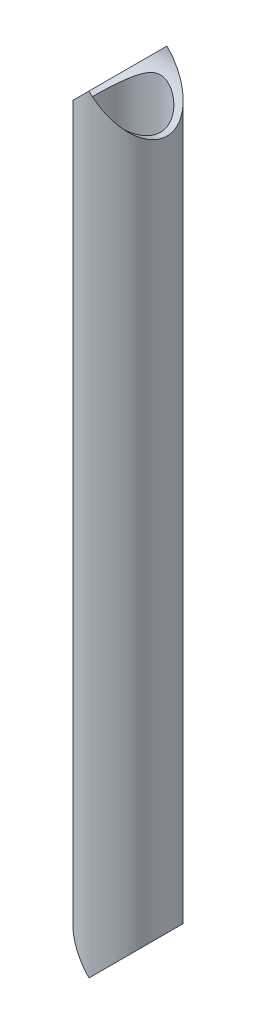
ISO-10303-21;
HEADER;
FILE_DESCRIPTION(('STEP AP214'),'2;1');
FILE_NAME('part.step','',(''),(''),'','','');
FILE_SCHEMA(('AUTOMOTIVE_DESIGN { 1 0 10303 214 1 1 1 1 }'));
ENDSEC;
DATA;
#1=APPLICATION_CONTEXT('core data for automotive mechanical design processes');
#2=APPLICATION_PROTOCOL_DEFINITION('international standard','automotive_design',2000,#1);
#3=PRODUCT_CONTEXT('',#1,'mechanical');
#4=PRODUCT('Part','Part','',(#3));
#5=PRODUCT_RELATED_PRODUCT_CATEGORY('part','',(#4));
#6=PRODUCT_DEFINITION_FORMATION('','',#4);
#7=PRODUCT_DEFINITION_CONTEXT('part definition',#1,'design');
#8=PRODUCT_DEFINITION('design','',#6,#7);
#9=PRODUCT_DEFINITION_SHAPE('','',#8);
#10=(LENGTH_UNIT() NAMED_UNIT(*) SI_UNIT(.MILLI.,.METRE.));
#11=(NAMED_UNIT(*) PLANE_ANGLE_UNIT() SI_UNIT($,.RADIAN.));
#12=(NAMED_UNIT(*) SI_UNIT($,.STERADIAN.) SOLID_ANGLE_UNIT());
#13=UNCERTAINTY_MEASURE_WITH_UNIT(LENGTH_MEASURE(1.E-05),#10,'distance_accuracy_value','');
#14=(GEOMETRIC_REPRESENTATION_CONTEXT(3) GLOBAL_UNCERTAINTY_ASSIGNED_CONTEXT((#13)) GLOBAL_UNIT_ASSIGNED_CONTEXT((#10,
#11,#12)) REPRESENTATION_CONTEXT('',''));
#15=CARTESIAN_POINT('',(0.,0.,0.));
#16=DIRECTION('',(0.,0.,1.));
#17=DIRECTION('',(1.,0.,0.));
#18=AXIS2_PLACEMENT_3D('',#15,#16,#17);
#19=CARTESIAN_POINT('',(0.,-207.518,0.));
#20=DIRECTION('',(0.,1.,0.));
#21=DIRECTION('',(0.,0.,1.));
#22=AXIS2_PLACEMENT_3D('',#19,#20,#21);
#23=CYLINDRICAL_SURFACE('',#22,17.526);
#24=CARTESIAN_POINT('',(-17.526,-186.436,0.));
#25=CARTESIAN_POINT('',(-17.5259980790686,-186.436001869717,-0.416631891884529));
#26=CARTESIAN_POINT('',(-17.5111180143844,-186.448376702648,-0.833291614596573));
#27=CARTESIAN_POINT('',(-17.4518754486312,-186.497587613171,-1.66306415209241));
#28=CARTESIAN_POINT('',(-17.4075102476317,-186.534425930865,-2.07617663854929));
#29=CARTESIAN_POINT('',(-17.2900872977812,-186.631734477559,-2.89568705974647));
#30=CARTESIAN_POINT('',(-17.2170142136367,-186.692217337012,-3.30208128458832));
#31=CARTESIAN_POINT('',(-17.0434440095406,-186.835480003614,-4.1049225859492));
#32=CARTESIAN_POINT('',(-16.9429469099098,-186.918259794242,-4.50136966983866));
#33=CARTESIAN_POINT('',(-16.7167980768224,-187.103856892956,-5.27944200995072));
#34=CARTESIAN_POINT('',(-16.5913015575225,-187.206550462559,-5.66114217998166));
#35=CARTESIAN_POINT('',(-16.3165142511288,-187.430383542099,-6.41024393360111));
#36=CARTESIAN_POINT('',(-16.1672239534624,-187.551522672617,-6.77764581110571));
#37=CARTESIAN_POINT('',(-15.8466059374724,-187.81023510043,-7.49671581118124));
#38=CARTESIAN_POINT('',(-15.6752760379645,-187.947810024224,-7.8483823718324));
#39=CARTESIAN_POINT('',(-15.3122919872886,-188.237326869237,-8.5349424404551));
#40=CARTESIAN_POINT('',(-15.1206335269885,-188.389271835794,-8.86983236997341));
#41=CARTESIAN_POINT('',(-14.6449371899327,-188.763390323128,-9.64160148099855));
#42=CARTESIAN_POINT('',(-14.35277428092,-188.990903259878,-10.0709122769917));
#43=CARTESIAN_POINT('',(-13.7370016154288,-189.463739440463,-10.8958994551619));
#44=CARTESIAN_POINT('',(-13.4133812541277,-189.709068683368,-11.2915644099101));
#45=CARTESIAN_POINT('',(-12.7366562994745,-190.213050080413,-12.0497774892056));
#46=CARTESIAN_POINT('',(-12.3834793039229,-190.471734318499,-12.4122394487072));
#47=CARTESIAN_POINT('',(-11.6503539028584,-190.99664243174,-13.1028064141256));
#48=CARTESIAN_POINT('',(-11.2704088544898,-191.262865358927,-13.4309157156317));
#49=CARTESIAN_POINT('',(-10.4776074832354,-191.802267044711,-14.058474508539));
#50=CARTESIAN_POINT('',(-10.0642773274174,-192.075484114896,-14.3572922158469));
#51=CARTESIAN_POINT('',(-9.21095417180202,-192.617563798245,-14.9191173098571));
#52=CARTESIAN_POINT('',(-8.77095232335846,-192.886424928369,-15.1821127170899));
#53=CARTESIAN_POINT('',(-7.86481771696897,-193.410941896106,-15.6706644706901));
#54=CARTESIAN_POINT('',(-7.39875079698375,-193.666628126218,-15.8963099105176));
#55=CARTESIAN_POINT('',(-6.43838011624403,-194.154920126871,-16.3089150152554));
#56=CARTESIAN_POINT('',(-5.94410093685272,-194.387545520837,-16.4959077210257));
#57=CARTESIAN_POINT('',(-5.15602713461918,-194.719142409941,-16.7529770183563));
#58=CARTESIAN_POINT('',(-4.87241122579885,-194.831056828241,-16.8377355356669));
#59=CARTESIAN_POINT('',(-4.29634478402695,-195.040955435799,-16.9938564640281));
#60=CARTESIAN_POINT('',(-4.00389311343183,-195.138937821898,-17.0652171414406));
#61=CARTESIAN_POINT('',(-3.41127310107361,-195.317703328799,-17.1934753974398));
#62=CARTESIAN_POINT('',(-3.11112107688254,-195.398519915406,-17.2504011606098));
#63=CARTESIAN_POINT('',(-2.50374825167056,-195.540033133375,-17.3489622221163));
#64=CARTESIAN_POINT('',(-2.19653126072422,-195.600740349493,-17.3906055657459));
#65=CARTESIAN_POINT('',(-1.57275030198952,-195.699892310118,-17.4581423992254));
#66=CARTESIAN_POINT('',(-1.25611741342651,-195.738048045836,-17.4838316318924));
#67=CARTESIAN_POINT('',(-0.619878138777145,-195.788814341253,-17.5179303907999));
#68=CARTESIAN_POINT('',(-0.300272023197929,-195.80142720247,-17.5263414738735));
#69=CARTESIAN_POINT('',(0.338899727230866,-195.800373769192,-17.5256372420332));
#70=CARTESIAN_POINT('',(0.658465358058821,-195.786705753694,-17.5165207793285));
#71=CARTESIAN_POINT('',(1.29450954509331,-195.733888594821,-17.4810304641374));
#72=CARTESIAN_POINT('',(1.61098771371824,-195.694736293037,-17.4546544725793));
#73=CARTESIAN_POINT('',(2.26597232429025,-195.588574174166,-17.3822894554488));
#74=CARTESIAN_POINT('',(2.60395741877091,-195.519410486165,-17.334774736316));
#75=CARTESIAN_POINT('',(3.27094353248152,-195.357229978505,-17.221385971186));
#76=CARTESIAN_POINT('',(3.59994308630082,-195.264209293517,-17.1555089499647));
#77=CARTESIAN_POINT('',(4.24855969720268,-195.058248125281,-17.0065124919798));
#78=CARTESIAN_POINT('',(4.56814953492198,-194.945255428637,-16.9233477565931));
#79=CARTESIAN_POINT('',(5.19667656849724,-194.703503271269,-16.741038101444));
#80=CARTESIAN_POINT('',(5.50560955027848,-194.574737662966,-16.6418869460964));
#81=CARTESIAN_POINT('',(6.28987347341688,-194.226396984094,-16.3663636493324));
#82=CARTESIAN_POINT('',(6.75718025521281,-193.997655577264,-16.1786782502658));
#83=CARTESIAN_POINT('',(7.66612078661562,-193.521226023091,-15.7683261665334));
#84=CARTESIAN_POINT('',(8.10773947286392,-193.273526952329,-15.5456392349102));
#85=CARTESIAN_POINT('',(8.966836910621,-192.767622629837,-15.066475124559));
#86=CARTESIAN_POINT('',(9.38428239246995,-192.509403694397,-14.8099528974554));
#87=CARTESIAN_POINT('',(10.1948090672195,-191.989716727198,-14.2641228684251));
#88=CARTESIAN_POINT('',(10.58789508607,-191.728249351402,-13.9748215928149));
#89=CARTESIAN_POINT('',(11.3687731946263,-191.194586957206,-13.3482093999188));
#90=CARTESIAN_POINT('',(11.7553013794754,-190.922514943928,-13.0092142605656));
#91=CARTESIAN_POINT('',(12.5001422324198,-190.386837774516,-12.2952548941142));
#92=CARTESIAN_POINT('',(12.8584506208612,-190.123233906189,-11.9202852303774));
#93=CARTESIAN_POINT('',(13.5440372996657,-189.61047778169,-11.1351119046645));
#94=CARTESIAN_POINT('',(13.8713710412073,-189.361300022646,-10.7249738116483));
#95=CARTESIAN_POINT('',(14.337116723475,-189.00224331177,-10.083528945835));
#96=CARTESIAN_POINT('',(14.4881418292696,-188.885020748063,-9.8653649320548));
#97=CARTESIAN_POINT('',(14.7813992076686,-188.656096607668,-9.42029480496449));
#98=CARTESIAN_POINT('',(14.9236293115641,-188.544396394055,-9.19338655767707));
#99=CARTESIAN_POINT('',(15.2678710636928,-188.272693667739,-8.6148770358869));
#100=CARTESIAN_POINT('',(15.4640216769566,-188.116614462117,-8.25789744735692));
#101=CARTESIAN_POINT('',(15.8332690112885,-187.821040350126,-7.52571112583218));
#102=CARTESIAN_POINT('',(16.0063712866528,-187.681541449032,-7.15050881408722));
#103=CARTESIAN_POINT('',(16.3274115103296,-187.421593615499,-6.38349259773576));
#104=CARTESIAN_POINT('',(16.4753715932839,-187.301127933255,-5.9916936881111));
#105=CARTESIAN_POINT('',(16.7442387882183,-187.081425645806,-5.19312594032819));
#106=CARTESIAN_POINT('',(16.8651491964034,-186.982186454059,-4.78635893318675));
#107=CARTESIAN_POINT('',(17.0622544046955,-186.819982488146,-4.02147552090746));
#108=CARTESIAN_POINT('',(17.1424168859823,-186.753824232606,-3.66505417999647));
#109=CARTESIAN_POINT('',(17.2806615676892,-186.639547101224,-2.94511781335948));
#110=CARTESIAN_POINT('',(17.3387463272168,-186.591426134623,-2.58160361493049));
#111=CARTESIAN_POINT('',(17.4320228512749,-186.514076834347,-1.84968454444555));
#112=CARTESIAN_POINT('',(17.4672169849997,-186.484846545478,-1.48128018255333));
#113=CARTESIAN_POINT('',(17.5142075700851,-186.445806336805,-0.741924734095823));
#114=CARTESIAN_POINT('',(17.5260017104175,-186.435998335184,-0.370973399616659));
#115=CARTESIAN_POINT('',(17.5259980790686,-186.436001869717,0.41663189188453));
#116=CARTESIAN_POINT('',(17.5111180143844,-186.448376702648,0.833291614596573));
#117=CARTESIAN_POINT('',(17.4518754486312,-186.497587613171,1.66306415209241));
#118=CARTESIAN_POINT('',(17.4075102476317,-186.534425930865,2.0761766385493));
#119=CARTESIAN_POINT('',(17.2900872977812,-186.631734477559,2.89568705974647));
#120=CARTESIAN_POINT('',(17.2170142136367,-186.692217337012,3.30208128458832));
#121=CARTESIAN_POINT('',(17.0434440095406,-186.835480003614,4.10492258594921));
#122=CARTESIAN_POINT('',(16.9429469099098,-186.918259794242,4.50136966983866));
#123=CARTESIAN_POINT('',(16.7167980768224,-187.103856892956,5.27944200995072));
#124=CARTESIAN_POINT('',(16.5913015575225,-187.206550462559,5.66114217998167));
#125=CARTESIAN_POINT('',(16.3165142511288,-187.430383542099,6.41024393360111));
#126=CARTESIAN_POINT('',(16.1672239534624,-187.551522672617,6.77764581110572));
#127=CARTESIAN_POINT('',(15.8466059374724,-187.81023510043,7.49671581118125));
#128=CARTESIAN_POINT('',(15.6752760379645,-187.947810024224,7.8483823718324));
#129=CARTESIAN_POINT('',(15.3122919872886,-188.237326869237,8.5349424404551));
#130=CARTESIAN_POINT('',(15.1206335269885,-188.389271835794,8.8698323699734));
#131=CARTESIAN_POINT('',(14.6449371899327,-188.763390323128,9.64160148099855));
#132=CARTESIAN_POINT('',(14.35277428092,-188.990903259878,10.0709122769917));
#133=CARTESIAN_POINT('',(13.7370016154288,-189.463739440463,10.8958994551619));
#134=CARTESIAN_POINT('',(13.4133812541277,-189.709068683368,11.2915644099101));
#135=CARTESIAN_POINT('',(12.7366562994745,-190.213050080413,12.0497774892056));
#136=CARTESIAN_POINT('',(12.3834793039229,-190.471734318499,12.4122394487072));
#137=CARTESIAN_POINT('',(11.6503539028584,-190.99664243174,13.1028064141256));
#138=CARTESIAN_POINT('',(11.2704088544898,-191.262865358927,13.4309157156317));
#139=CARTESIAN_POINT('',(10.4776074832354,-191.802267044711,14.058474508539));
#140=CARTESIAN_POINT('',(10.0642773274174,-192.075484114896,14.3572922158469));
#141=CARTESIAN_POINT('',(9.21095417180201,-192.617563798245,14.9191173098571));
#142=CARTESIAN_POINT('',(8.77095232335845,-192.886424928369,15.1821127170899));
#143=CARTESIAN_POINT('',(7.86481771696897,-193.410941896106,15.6706644706901));
#144=CARTESIAN_POINT('',(7.39875079698375,-193.666628126218,15.8963099105176));
#145=CARTESIAN_POINT('',(6.43838011624403,-194.154920126871,16.3089150152554));
#146=CARTESIAN_POINT('',(5.94410093685272,-194.387545520837,16.4959077210257));
#147=CARTESIAN_POINT('',(5.15602713461918,-194.719142409941,16.7529770183563));
#148=CARTESIAN_POINT('',(4.87241122579885,-194.831056828241,16.8377355356669));
#149=CARTESIAN_POINT('',(4.29634478402695,-195.040955435799,16.9938564640281));
#150=CARTESIAN_POINT('',(4.00389311343183,-195.138937821898,17.0652171414406));
#151=CARTESIAN_POINT('',(3.4112731010736,-195.317703328799,17.1934753974398));
#152=CARTESIAN_POINT('',(3.11112107688253,-195.398519915406,17.2504011606098));
#153=CARTESIAN_POINT('',(2.50374825167056,-195.540033133375,17.3489622221163));
#154=CARTESIAN_POINT('',(2.19653126072421,-195.600740349493,17.3906055657459));
#155=CARTESIAN_POINT('',(1.57275030198952,-195.699892310118,17.4581423992254));
#156=CARTESIAN_POINT('',(1.25611741342651,-195.738048045836,17.4838316318924));
#157=CARTESIAN_POINT('',(0.619878138777146,-195.788814341253,17.5179303907999));
#158=CARTESIAN_POINT('',(0.300272023197933,-195.80142720247,17.5263414738735));
#159=CARTESIAN_POINT('',(-0.338899727230862,-195.800373769192,17.5256372420332));
#160=CARTESIAN_POINT('',(-0.658465358058822,-195.786705753694,17.5165207793285));
#161=CARTESIAN_POINT('',(-1.29450954509332,-195.733888594821,17.4810304641374));
#162=CARTESIAN_POINT('',(-1.61098771371824,-195.694736293037,17.4546544725793));
#163=CARTESIAN_POINT('',(-2.26597232429025,-195.588574174166,17.3822894554488));
#164=CARTESIAN_POINT('',(-2.60395741877091,-195.519410486165,17.334774736316));
#165=CARTESIAN_POINT('',(-3.27094353248152,-195.357229978505,17.221385971186));
#166=CARTESIAN_POINT('',(-3.59994308630082,-195.264209293517,17.1555089499647));
#167=CARTESIAN_POINT('',(-4.24855969720269,-195.058248125281,17.0065124919798));
#168=CARTESIAN_POINT('',(-4.56814953492199,-194.945255428637,16.9233477565931));
#169=CARTESIAN_POINT('',(-5.19667656849724,-194.703503271269,16.741038101444));
#170=CARTESIAN_POINT('',(-5.50560955027847,-194.574737662966,16.6418869460964));
#171=CARTESIAN_POINT('',(-6.28987347341687,-194.226396984094,16.3663636493324));
#172=CARTESIAN_POINT('',(-6.7571802552128,-193.997655577264,16.1786782502658));
#173=CARTESIAN_POINT('',(-7.66612078661561,-193.521226023091,15.7683261665334));
#174=CARTESIAN_POINT('',(-8.10773947286391,-193.273526952329,15.5456392349102));
#175=CARTESIAN_POINT('',(-8.96683691062099,-192.767622629837,15.066475124559));
#176=CARTESIAN_POINT('',(-9.38428239246995,-192.509403694397,14.8099528974554));
#177=CARTESIAN_POINT('',(-10.1948090672196,-191.989716727198,14.2641228684251));
#178=CARTESIAN_POINT('',(-10.58789508607,-191.728249351402,13.9748215928149));
#179=CARTESIAN_POINT('',(-11.3687731946263,-191.194586957206,13.3482093999188));
#180=CARTESIAN_POINT('',(-11.7553013794754,-190.922514943928,13.0092142605656));
#181=CARTESIAN_POINT('',(-12.5001422324198,-190.386837774516,12.2952548941142));
#182=CARTESIAN_POINT('',(-12.8584506208612,-190.123233906189,11.9202852303774));
#183=CARTESIAN_POINT('',(-13.5440372996657,-189.61047778169,11.1351119046645));
#184=CARTESIAN_POINT('',(-13.8713710412073,-189.361300022646,10.7249738116483));
#185=CARTESIAN_POINT('',(-14.337116723475,-189.00224331177,10.083528945835));
#186=CARTESIAN_POINT('',(-14.4881418292696,-188.885020748063,9.86536493205481));
#187=CARTESIAN_POINT('',(-14.7813992076686,-188.656096607668,9.4202948049645));
#188=CARTESIAN_POINT('',(-14.9236293115641,-188.544396394055,9.19338655767707));
#189=CARTESIAN_POINT('',(-15.2678710636928,-188.272693667739,8.6148770358869));
#190=CARTESIAN_POINT('',(-15.4640216769566,-188.116614462117,8.25789744735692));
#191=CARTESIAN_POINT('',(-15.8332690112885,-187.821040350126,7.52571112583218));
#192=CARTESIAN_POINT('',(-16.0063712866528,-187.681541449032,7.15050881408723));
#193=CARTESIAN_POINT('',(-16.3274115103296,-187.421593615499,6.38349259773576));
#194=CARTESIAN_POINT('',(-16.4753715932839,-187.301127933255,5.9916936881111));
#195=CARTESIAN_POINT('',(-16.7442387882183,-187.081425645806,5.19312594032818));
#196=CARTESIAN_POINT('',(-16.8651491964034,-186.982186454059,4.78635893318675));
#197=CARTESIAN_POINT('',(-17.0622544046955,-186.819982488146,4.02147552090745));
#198=CARTESIAN_POINT('',(-17.1424168859823,-186.753824232606,3.66505417999646));
#199=CARTESIAN_POINT('',(-17.2806615676892,-186.639547101224,2.94511781335948));
#200=CARTESIAN_POINT('',(-17.3387463272168,-186.591426134623,2.58160361493049));
#201=CARTESIAN_POINT('',(-17.4320228512749,-186.514076834347,1.84968454444555));
#202=CARTESIAN_POINT('',(-17.4672169849997,-186.484846545478,1.48128018255333));
#203=CARTESIAN_POINT('',(-17.5142075700851,-186.445806336805,0.741924734095821));
#204=CARTESIAN_POINT('',(-17.5260017104175,-186.435998335184,0.370973399616659));
#205=CARTESIAN_POINT('',(-17.526,-186.436,0.));
#206=B_SPLINE_CURVE_WITH_KNOTS('',3,(#24,#25,#26,#27,#28,#29,#30,#31,#32,#33,#34,#35,#36,#37,
#38,#39,#40,#41,#42,#43,#44,#45,#46,#47,#48,#49,#50,#51,#52,#53,#54,#55,#56,#57,#58,#59,#60,#61,
#62,#63,#64,#65,#66,#67,#68,#69,#70,#71,#72,#73,#74,#75,#76,#77,#78,#79,#80,#81,#82,#83,#84,#85,
#86,#87,#88,#89,#90,#91,#92,#93,#94,#95,#96,#97,#98,#99,#100,#101,#102,#103,#104,#105,#106,#107,
#108,#109,#110,#111,#112,#113,#114,#115,#116,#117,#118,#119,#120,#121,#122,#123,#124,#125,#126,
#127,#128,#129,#130,#131,#132,#133,#134,#135,#136,#137,#138,#139,#140,#141,#142,#143,#144,#145,
#146,#147,#148,#149,#150,#151,#152,#153,#154,#155,#156,#157,#158,#159,#160,#161,#162,#163,#164,
#165,#166,#167,#168,#169,#170,#171,#172,#173,#174,#175,#176,#177,#178,#179,#180,#181,#182,#183,
#184,#185,#186,#187,#188,#189,#190,#191,#192,#193,#194,#195,#196,#197,#198,#199,#200,#201,#202,
#203,#204,#205),.UNSPECIFIED.,.T.,.F.,(4,2,2,2,2,2,2,2,2,2,2,2,2,2,2,2,2,2,2,2,2,2,2,2,2,2,2,2,
2,2,2,2,2,2,2,2,2,2,2,2,2,2,2,2,2,2,2,2,2,2,2,2,2,2,2,2,2,2,2,2,2,2,2,2,2,2,2,2,2,2,2,2,2,2,2,2,
2,2,2,2,2,2,2,2,2,2,2,2,2,2,4),(0.,1.24949934855756,2.49911312853975,3.74939534191412,
4.99967662885311,6.24242452622057,7.48514686411974,8.72799228476734,9.97110168518414,
11.669501012606,13.3684748971781,15.0717397764303,16.7747914178441,18.5089011871743,
20.243589450297,21.974078274241,23.7030816801075,24.6518793393344,25.600799685493,
26.5478527179048,27.4944064650862,28.4528415801625,29.4111903324619,30.3696018443357,
31.328132160104,32.3712695138643,33.4145759843964,34.4606514688156,35.5071359718705,
37.1638896134146,38.8216051704627,40.4815505217246,42.1411659563,43.8843738766099,
45.6278456548924,47.3681347383873,48.2380995270287,49.1082779868029,50.4155878903855,
51.7225821799056,53.0284197904999,54.3340981882379,55.4467998172027,56.5593724295939,
57.6718298716841,58.7843971767374,60.0338965252949,61.2835103052771,62.5337925186515,
63.7840738055905,65.0268217029579,66.2695440408571,67.5123894615047,68.7554988619215,
70.4538981893433,72.1528720739155,73.8561369531677,75.5591885945814,77.2932983639116,
79.0279866270344,80.7584754509784,82.4874788568449,83.4362765160718,84.3851968622303,
85.3322498946422,86.2788036418235,87.2372387568998,88.1955875091992,89.153999021073,
90.1125293368414,91.1556666906017,92.1989731611338,93.245048645553,94.2915331486079,
95.9482867901519,97.6060023472,99.2659476984619,100.925563133037,102.668771053347,
104.41224283163,106.152531915125,107.022496703766,107.89267516354,109.199985067123,
110.506979356643,111.812816967237,113.118495364975,114.23119699394,115.343769606331,
116.456227048421,117.568794353475),.UNSPECIFIED.);
#207=CARTESIAN_POINT('',(-17.526,-186.436,0.));
#208=VERTEX_POINT('',#207);
#209=EDGE_CURVE('E21',#208,#208,#206,.T.);
#210=ORIENTED_EDGE('',*,*,#209,.T.);
#211=EDGE_LOOP('',(#210));
#212=FACE_BOUND('',#211,.T.);
#213=CARTESIAN_POINT('',(17.526,186.436,0.));
#214=CARTESIAN_POINT('',(17.5259980790686,186.436001869717,-0.416631891884528));
#215=CARTESIAN_POINT('',(17.5111180143844,186.448376702648,-0.833291614596573));
#216=CARTESIAN_POINT('',(17.4518754486312,186.497587613171,-1.66306415209241));
#217=CARTESIAN_POINT('',(17.4075102476317,186.534425930865,-2.07617663854929));
#218=CARTESIAN_POINT('',(17.2900872977812,186.631734477559,-2.89568705974646));
#219=CARTESIAN_POINT('',(17.2170142136367,186.692217337012,-3.30208128458832));
#220=CARTESIAN_POINT('',(17.0434440095406,186.835480003614,-4.1049225859492));
#221=CARTESIAN_POINT('',(16.9429469099098,186.918259794242,-4.50136966983866));
#222=CARTESIAN_POINT('',(16.7167980768224,187.103856892956,-5.27944200995072));
#223=CARTESIAN_POINT('',(16.5913015575225,187.206550462559,-5.66114217998166));
#224=CARTESIAN_POINT('',(16.3165142511288,187.430383542099,-6.41024393360111));
#225=CARTESIAN_POINT('',(16.1672239534624,187.551522672617,-6.77764581110572));
#226=CARTESIAN_POINT('',(15.8466059374724,187.81023510043,-7.49671581118126));
#227=CARTESIAN_POINT('',(15.6752760379645,187.947810024224,-7.84838237183241));
#228=CARTESIAN_POINT('',(15.3122919872886,188.237326869237,-8.53494244045511));
#229=CARTESIAN_POINT('',(15.1206335269885,188.389271835794,-8.86983236997341));
#230=CARTESIAN_POINT('',(14.6449371899327,188.763390323128,-9.64160148099855));
#231=CARTESIAN_POINT('',(14.35277428092,188.990903259878,-10.0709122769917));
#232=CARTESIAN_POINT('',(13.7370016154288,189.463739440463,-10.8958994551619));
#233=CARTESIAN_POINT('',(13.4133812541277,189.709068683368,-11.2915644099101));
#234=CARTESIAN_POINT('',(12.7366562994745,190.213050080413,-12.0497774892056));
#235=CARTESIAN_POINT('',(12.3834793039229,190.471734318499,-12.4122394487072));
#236=CARTESIAN_POINT('',(11.6503539028584,190.99664243174,-13.1028064141256));
#237=CARTESIAN_POINT('',(11.2704088544898,191.262865358927,-13.4309157156317));
#238=CARTESIAN_POINT('',(10.4776074832354,191.802267044711,-14.058474508539));
#239=CARTESIAN_POINT('',(10.0642773274174,192.075484114896,-14.3572922158469));
#240=CARTESIAN_POINT('',(9.21095417180202,192.617563798245,-14.9191173098571));
#241=CARTESIAN_POINT('',(8.77095232335846,192.886424928369,-15.1821127170899));
#242=CARTESIAN_POINT('',(7.86481771696897,193.410941896106,-15.6706644706901));
#243=CARTESIAN_POINT('',(7.39875079698375,193.666628126218,-15.8963099105176));
#244=CARTESIAN_POINT('',(6.43838011624403,194.154920126871,-16.3089150152554));
#245=CARTESIAN_POINT('',(5.94410093685272,194.387545520837,-16.4959077210257));
#246=CARTESIAN_POINT('',(5.15602713461918,194.719142409941,-16.7529770183563));
#247=CARTESIAN_POINT('',(4.87241122579885,194.831056828241,-16.8377355356669));
#248=CARTESIAN_POINT('',(4.29634478402695,195.040955435799,-16.9938564640281));
#249=CARTESIAN_POINT('',(4.00389311343183,195.138937821898,-17.0652171414406));
#250=CARTESIAN_POINT('',(3.41127310107361,195.317703328799,-17.1934753974398));
#251=CARTESIAN_POINT('',(3.11112107688254,195.398519915406,-17.2504011606098));
#252=CARTESIAN_POINT('',(2.50374825167056,195.540033133375,-17.3489622221163));
#253=CARTESIAN_POINT('',(2.19653126072422,195.600740349493,-17.3906055657459));
#254=CARTESIAN_POINT('',(1.57275030198952,195.699892310118,-17.4581423992254));
#255=CARTESIAN_POINT('',(1.25611741342651,195.738048045836,-17.4838316318924));
#256=CARTESIAN_POINT('',(0.619878138777148,195.788814341253,-17.5179303907999));
#257=CARTESIAN_POINT('',(0.300272023197931,195.80142720247,-17.5263414738735));
#258=CARTESIAN_POINT('',(-0.338899727230864,195.800373769192,-17.5256372420332));
#259=CARTESIAN_POINT('',(-0.658465358058819,195.786705753694,-17.5165207793285));
#260=CARTESIAN_POINT('',(-1.29450954509331,195.733888594821,-17.4810304641374));
#261=CARTESIAN_POINT('',(-1.61098771371824,195.694736293037,-17.4546544725793));
#262=CARTESIAN_POINT('',(-2.26597232429025,195.588574174166,-17.3822894554488));
#263=CARTESIAN_POINT('',(-2.60395741877091,195.519410486165,-17.334774736316));
#264=CARTESIAN_POINT('',(-3.27094353248152,195.357229978505,-17.221385971186));
#265=CARTESIAN_POINT('',(-3.59994308630082,195.264209293517,-17.1555089499647));
#266=CARTESIAN_POINT('',(-4.24855969720269,195.058248125281,-17.0065124919798));
#267=CARTESIAN_POINT('',(-4.56814953492199,194.945255428637,-16.9233477565931));
#268=CARTESIAN_POINT('',(-5.19667656849724,194.703503271269,-16.741038101444));
#269=CARTESIAN_POINT('',(-5.50560955027847,194.574737662966,-16.6418869460964));
#270=CARTESIAN_POINT('',(-6.28987347341687,194.226396984094,-16.3663636493324));
#271=CARTESIAN_POINT('',(-6.75718025521281,193.997655577264,-16.1786782502658));
#272=CARTESIAN_POINT('',(-7.66612078661562,193.521226023091,-15.7683261665334));
#273=CARTESIAN_POINT('',(-8.10773947286392,193.273526952329,-15.5456392349102));
#274=CARTESIAN_POINT('',(-8.96683691062099,192.767622629837,-15.066475124559));
#275=CARTESIAN_POINT('',(-9.38428239246995,192.509403694397,-14.8099528974554));
#276=CARTESIAN_POINT('',(-10.1948090672195,191.989716727198,-14.2641228684251));
#277=CARTESIAN_POINT('',(-10.58789508607,191.728249351402,-13.9748215928149));
#278=CARTESIAN_POINT('',(-11.3687731946263,191.194586957206,-13.3482093999188));
#279=CARTESIAN_POINT('',(-11.7553013794754,190.922514943928,-13.0092142605656));
#280=CARTESIAN_POINT('',(-12.5001422324198,190.386837774517,-12.2952548941142));
#281=CARTESIAN_POINT('',(-12.8584506208612,190.123233906189,-11.9202852303774));
#282=CARTESIAN_POINT('',(-13.5440372996657,189.61047778169,-11.1351119046645));
#283=CARTESIAN_POINT('',(-13.8713710412073,189.361300022646,-10.7249738116483));
#284=CARTESIAN_POINT('',(-14.337116723475,189.00224331177,-10.083528945835));
#285=CARTESIAN_POINT('',(-14.4881418292696,188.885020748063,-9.8653649320548));
#286=CARTESIAN_POINT('',(-14.7813992076686,188.656096607668,-9.4202948049645));
#287=CARTESIAN_POINT('',(-14.9236293115641,188.544396394055,-9.19338655767707));
#288=CARTESIAN_POINT('',(-15.2678710636928,188.272693667739,-8.6148770358869));
#289=CARTESIAN_POINT('',(-15.4640216769566,188.116614462117,-8.25789744735692));
#290=CARTESIAN_POINT('',(-15.8332690112885,187.821040350126,-7.52571112583218));
#291=CARTESIAN_POINT('',(-16.0063712866528,187.681541449032,-7.15050881408722));
#292=CARTESIAN_POINT('',(-16.3274115103296,187.421593615499,-6.38349259773576));
#293=CARTESIAN_POINT('',(-16.4753715932839,187.301127933255,-5.9916936881111));
#294=CARTESIAN_POINT('',(-16.7442387882183,187.081425645806,-5.19312594032818));
#295=CARTESIAN_POINT('',(-16.8651491964034,186.982186454059,-4.78635893318675));
#296=CARTESIAN_POINT('',(-17.0622544046955,186.819982488146,-4.02147552090745));
#297=CARTESIAN_POINT('',(-17.1424168859823,186.753824232606,-3.66505417999646));
#298=CARTESIAN_POINT('',(-17.2806615676892,186.639547101224,-2.94511781335948));
#299=CARTESIAN_POINT('',(-17.3387463272168,186.591426134623,-2.58160361493049));
#300=CARTESIAN_POINT('',(-17.4320228512749,186.514076834347,-1.84968454444555));
#301=CARTESIAN_POINT('',(-17.4672169849997,186.484846545478,-1.48128018255334));
#302=CARTESIAN_POINT('',(-17.5142075700851,186.445806336805,-0.741924734095824));
#303=CARTESIAN_POINT('',(-17.5260017104175,186.435998335184,-0.37097339961666));
#304=CARTESIAN_POINT('',(-17.5259980790686,186.436001869717,0.416631891884531));
#305=CARTESIAN_POINT('',(-17.5111180143844,186.448376702647,0.833291614596578));
#306=CARTESIAN_POINT('',(-17.4518754486312,186.497587613171,1.66306415209241));
#307=CARTESIAN_POINT('',(-17.4075102476317,186.534425930865,2.0761766385493));
#308=CARTESIAN_POINT('',(-17.2900872977812,186.631734477559,2.89568705974646));
#309=CARTESIAN_POINT('',(-17.2170142136367,186.692217337012,3.30208128458832));
#310=CARTESIAN_POINT('',(-17.0434440095406,186.835480003614,4.1049225859492));
#311=CARTESIAN_POINT('',(-16.9429469099098,186.918259794242,4.50136966983866));
#312=CARTESIAN_POINT('',(-16.7167980768224,187.103856892956,5.27944200995072));
#313=CARTESIAN_POINT('',(-16.5913015575225,187.206550462559,5.66114217998166));
#314=CARTESIAN_POINT('',(-16.3165142511288,187.430383542099,6.41024393360111));
#315=CARTESIAN_POINT('',(-16.1672239534624,187.551522672617,6.77764581110571));
#316=CARTESIAN_POINT('',(-15.8466059374724,187.81023510043,7.49671581118125));
#317=CARTESIAN_POINT('',(-15.6752760379645,187.947810024224,7.84838237183241));
#318=CARTESIAN_POINT('',(-15.3122919872886,188.237326869237,8.5349424404551));
#319=CARTESIAN_POINT('',(-15.1206335269885,188.389271835794,8.8698323699734));
#320=CARTESIAN_POINT('',(-14.6449371899327,188.763390323128,9.64160148099855));
#321=CARTESIAN_POINT('',(-14.35277428092,188.990903259878,10.0709122769917));
#322=CARTESIAN_POINT('',(-13.7370016154288,189.463739440463,10.8958994551619));
#323=CARTESIAN_POINT('',(-13.4133812541277,189.709068683368,11.2915644099101));
#324=CARTESIAN_POINT('',(-12.7366562994745,190.213050080413,12.0497774892056));
#325=CARTESIAN_POINT('',(-12.3834793039229,190.471734318499,12.4122394487072));
#326=CARTESIAN_POINT('',(-11.6503539028584,190.99664243174,13.1028064141256));
#327=CARTESIAN_POINT('',(-11.2704088544898,191.262865358927,13.4309157156317));
#328=CARTESIAN_POINT('',(-10.4776074832354,191.802267044711,14.058474508539));
#329=CARTESIAN_POINT('',(-10.0642773274174,192.075484114896,14.3572922158469));
#330=CARTESIAN_POINT('',(-9.21095417180201,192.617563798245,14.9191173098571));
#331=CARTESIAN_POINT('',(-8.77095232335846,192.886424928369,15.1821127170899));
#332=CARTESIAN_POINT('',(-7.86481771696897,193.410941896106,15.6706644706901));
#333=CARTESIAN_POINT('',(-7.39875079698375,193.666628126218,15.8963099105176));
#334=CARTESIAN_POINT('',(-6.43838011624403,194.154920126871,16.3089150152554));
#335=CARTESIAN_POINT('',(-5.94410093685272,194.387545520837,16.4959077210257));
#336=CARTESIAN_POINT('',(-5.15602713461918,194.719142409941,16.7529770183563));
#337=CARTESIAN_POINT('',(-4.87241122579885,194.831056828241,16.8377355356669));
#338=CARTESIAN_POINT('',(-4.29634478402695,195.040955435799,16.9938564640281));
#339=CARTESIAN_POINT('',(-4.00389311343183,195.138937821898,17.0652171414406));
#340=CARTESIAN_POINT('',(-3.4112731010736,195.317703328799,17.1934753974398));
#341=CARTESIAN_POINT('',(-3.11112107688253,195.398519915406,17.2504011606098));
#342=CARTESIAN_POINT('',(-2.50374825167056,195.540033133375,17.3489622221163));
#343=CARTESIAN_POINT('',(-2.19653126072421,195.600740349493,17.3906055657459));
#344=CARTESIAN_POINT('',(-1.57275030198952,195.699892310118,17.4581423992254));
#345=CARTESIAN_POINT('',(-1.25611741342652,195.738048045836,17.4838316318924));
#346=CARTESIAN_POINT('',(-0.619878138777156,195.788814341253,17.5179303907999));
#347=CARTESIAN_POINT('',(-0.300272023197938,195.80142720247,17.5263414738735));
#348=CARTESIAN_POINT('',(0.338899727230859,195.800373769192,17.5256372420332));
#349=CARTESIAN_POINT('',(0.658465358058814,195.786705753694,17.5165207793285));
#350=CARTESIAN_POINT('',(1.29450954509331,195.733888594821,17.4810304641374));
#351=CARTESIAN_POINT('',(1.61098771371824,195.694736293037,17.4546544725793));
#352=CARTESIAN_POINT('',(2.26597232429025,195.588574174166,17.3822894554488));
#353=CARTESIAN_POINT('',(2.60395741877092,195.519410486165,17.334774736316));
#354=CARTESIAN_POINT('',(3.27094353248153,195.357229978505,17.221385971186));
#355=CARTESIAN_POINT('',(3.59994308630082,195.264209293517,17.1555089499647));
#356=CARTESIAN_POINT('',(4.24855969720269,195.058248125281,17.0065124919798));
#357=CARTESIAN_POINT('',(4.56814953492199,194.945255428637,16.9233477565931));
#358=CARTESIAN_POINT('',(5.19667656849724,194.703503271269,16.741038101444));
#359=CARTESIAN_POINT('',(5.50560955027848,194.574737662966,16.6418869460964));
#360=CARTESIAN_POINT('',(6.28987347341688,194.226396984094,16.3663636493324));
#361=CARTESIAN_POINT('',(6.7571802552128,193.997655577264,16.1786782502658));
#362=CARTESIAN_POINT('',(7.66612078661561,193.521226023091,15.7683261665334));
#363=CARTESIAN_POINT('',(8.10773947286392,193.273526952329,15.5456392349102));
#364=CARTESIAN_POINT('',(8.966836910621,192.767622629837,15.066475124559));
#365=CARTESIAN_POINT('',(9.38428239246996,192.509403694397,14.8099528974554));
#366=CARTESIAN_POINT('',(10.1948090672195,191.989716727198,14.2641228684251));
#367=CARTESIAN_POINT('',(10.58789508607,191.728249351402,13.9748215928149));
#368=CARTESIAN_POINT('',(11.3687731946263,191.194586957206,13.3482093999188));
#369=CARTESIAN_POINT('',(11.7553013794754,190.922514943928,13.0092142605656));
#370=CARTESIAN_POINT('',(12.5001422324198,190.386837774517,12.2952548941142));
#371=CARTESIAN_POINT('',(12.8584506208612,190.123233906189,11.9202852303774));
#372=CARTESIAN_POINT('',(13.5440372996657,189.61047778169,11.1351119046645));
#373=CARTESIAN_POINT('',(13.8713710412073,189.361300022646,10.7249738116483));
#374=CARTESIAN_POINT('',(14.337116723475,189.00224331177,10.0835289458351));
#375=CARTESIAN_POINT('',(14.4881418292696,188.885020748063,9.86536493205482));
#376=CARTESIAN_POINT('',(14.7813992076686,188.656096607668,9.42029480496451));
#377=CARTESIAN_POINT('',(14.9236293115641,188.544396394055,9.19338655767708));
#378=CARTESIAN_POINT('',(15.2678710636928,188.272693667739,8.6148770358869));
#379=CARTESIAN_POINT('',(15.4640216769566,188.116614462117,8.25789744735692));
#380=CARTESIAN_POINT('',(15.8332690112885,187.821040350126,7.52571112583218));
#381=CARTESIAN_POINT('',(16.0063712866528,187.681541449032,7.15050881408723));
#382=CARTESIAN_POINT('',(16.3274115103296,187.421593615499,6.38349259773577));
#383=CARTESIAN_POINT('',(16.4753715932839,187.301127933255,5.9916936881111));
#384=CARTESIAN_POINT('',(16.7442387882183,187.081425645806,5.19312594032819));
#385=CARTESIAN_POINT('',(16.8651491964034,186.982186454059,4.78635893318675));
#386=CARTESIAN_POINT('',(17.0622544046955,186.819982488146,4.02147552090746));
#387=CARTESIAN_POINT('',(17.1424168859823,186.753824232606,3.66505417999647));
#388=CARTESIAN_POINT('',(17.2806615676892,186.639547101224,2.94511781335948));
#389=CARTESIAN_POINT('',(17.3387463272168,186.591426134623,2.58160361493049));
#390=CARTESIAN_POINT('',(17.4320228512749,186.514076834347,1.84968454444556));
#391=CARTESIAN_POINT('',(17.4672169849997,186.484846545478,1.48128018255334));
#392=CARTESIAN_POINT('',(17.5142075700851,186.445806336805,0.741924734095832));
#393=CARTESIAN_POINT('',(17.5260017104175,186.435998335184,0.370973399616665));
#394=CARTESIAN_POINT('',(17.526,186.436,0.));
#395=B_SPLINE_CURVE_WITH_KNOTS('',3,(#213,#214,#215,#216,#217,#218,#219,#220,#221,#222,#223,
#224,#225,#226,#227,#228,#229,#230,#231,#232,#233,#234,#235,#236,#237,#238,#239,#240,#241,#242,
#243,#244,#245,#246,#247,#248,#249,#250,#251,#252,#253,#254,#255,#256,#257,#258,#259,#260,#261,
#262,#263,#264,#265,#266,#267,#268,#269,#270,#271,#272,#273,#274,#275,#276,#277,#278,#279,#280,
#281,#282,#283,#284,#285,#286,#287,#288,#289,#290,#291,#292,#293,#294,#295,#296,#297,#298,#299,
#300,#301,#302,#303,#304,#305,#306,#307,#308,#309,#310,#311,#312,#313,#314,#315,#316,#317,#318,
#319,#320,#321,#322,#323,#324,#325,#326,#327,#328,#329,#330,#331,#332,#333,#334,#335,#336,#337,
#338,#339,#340,#341,#342,#343,#344,#345,#346,#347,#348,#349,#350,#351,#352,#353,#354,#355,#356,
#357,#358,#359,#360,#361,#362,#363,#364,#365,#366,#367,#368,#369,#370,#371,#372,#373,#374,#375,
#376,#377,#378,#379,#380,#381,#382,#383,#384,#385,#386,#387,#388,#389,#390,#391,#392,#393,#394),
.UNSPECIFIED.,.T.,.F.,(4,2,2,2,2,2,2,2,2,2,2,2,2,2,2,2,2,2,2,2,2,2,2,2,2,2,2,2,2,2,2,2,2,2,2,2,
2,2,2,2,2,2,2,2,2,2,2,2,2,2,2,2,2,2,2,2,2,2,2,2,2,2,2,2,2,2,2,2,2,2,2,2,2,2,2,2,2,2,2,2,2,2,2,2,
2,2,2,2,2,2,4),(0.,1.24949934855756,2.49911312853975,3.74939534191412,4.99967662885311,
6.24242452622057,7.48514686411976,8.72799228476735,9.97110168518414,11.669501012606,
13.3684748971782,15.0717397764303,16.7747914178441,18.5089011871743,20.243589450297,
21.974078274241,23.7030816801075,24.6518793393344,25.600799685493,26.5478527179048,
27.4944064650861,28.4528415801624,29.4111903324619,30.3696018443357,31.328132160104,
32.3712695138643,33.4145759843964,34.4606514688156,35.5071359718705,37.1638896134146,
38.8216051704627,40.4815505217246,42.1411659562999,43.8843738766099,45.6278456548924,
47.3681347383873,48.2380995270287,49.1082779868029,50.4155878903855,51.7225821799055,
53.0284197904999,54.3340981882378,55.4467998172027,56.5593724295939,57.6718298716841,
58.7843971767373,60.0338965252949,61.2835103052771,62.5337925186514,63.7840738055904,
65.0268217029579,66.2695440408571,67.5123894615047,68.7554988619215,70.4538981893432,
72.1528720739155,73.8561369531677,75.5591885945814,77.2932983639116,79.0279866270344,
80.7584754509783,82.4874788568448,83.4362765160717,84.3851968622303,85.3322498946421,
86.2788036418234,87.2372387568997,88.1955875091992,89.1539990210729,90.1125293368413,
91.1556666906016,92.1989731611337,93.2450486455529,94.2915331486078,95.9482867901519,
97.6060023472,99.2659476984619,100.925563133037,102.668771053347,104.41224283163,
106.152531915125,107.022496703766,107.89267516354,109.199985067123,110.506979356643,
111.812816967237,113.118495364975,114.23119699394,115.343769606331,116.456227048421,
117.568794353475),.UNSPECIFIED.);
#396=CARTESIAN_POINT('',(17.526,186.436,0.));
#397=VERTEX_POINT('',#396);
#398=EDGE_CURVE('E49',#397,#397,#395,.T.);
#399=ORIENTED_EDGE('',*,*,#398,.T.);
#400=EDGE_LOOP('',(#399));
#401=FACE_BOUND('',#400,.T.);
#402=ADVANCED_FACE('F17',(#212,#401),#23,.F.);
#403=CARTESIAN_POINT('',(25.2984,-207.518,0.));
#404=DIRECTION('',(1.,0.,0.));
#405=DIRECTION('',(0.,0.,-1.));
#406=AXIS2_PLACEMENT_3D('',#403,#404,#405);
#407=CYLINDRICAL_SURFACE('',#406,21.082);
#408=ORIENTED_EDGE('',*,*,#209,.F.);
#409=EDGE_LOOP('',(#408));
#410=FACE_BOUND('',#409,.T.);
#411=CARTESIAN_POINT('',(0.,-207.518,0.));
#412=DIRECTION('',(0.707106781186547,0.707106781186547,0.));
#413=DIRECTION('',(0.707106781186547,-0.707106781186547,0.));
#414=AXIS2_PLACEMENT_3D('',#411,#412,#413);
#415=ELLIPSE('',#414,29.8144503219496,21.082);
#416=CARTESIAN_POINT('',(0.,-207.518,-21.082));
#417=VERTEX_POINT('',#416);
#418=CARTESIAN_POINT('',(0.,-207.518,21.082));
#419=VERTEX_POINT('',#418);
#420=EDGE_CURVE('E44',#417,#419,#415,.T.);
#421=ORIENTED_EDGE('',*,*,#420,.F.);
#422=CARTESIAN_POINT('',(0.,-207.518,0.));
#423=DIRECTION('',(0.707106781186547,-0.707106781186547,0.));
#424=DIRECTION('',(0.707106781186547,0.707106781186547,0.));
#425=AXIS2_PLACEMENT_3D('',#422,#423,#424);
#426=ELLIPSE('',#425,29.8144503219496,21.082);
#427=EDGE_CURVE('E47',#419,#417,#426,.F.);
#428=ORIENTED_EDGE('',*,*,#427,.F.);
#429=EDGE_LOOP('',(#421,#428));
#430=FACE_BOUND('',#429,.T.);
#431=ADVANCED_FACE('F46',(#410,#430),#407,.F.);
#432=CARTESIAN_POINT('',(25.2984,207.518,0.));
#433=DIRECTION('',(-1.,0.,0.));
#434=DIRECTION('',(0.,0.,1.));
#435=AXIS2_PLACEMENT_3D('',#432,#433,#434);
#436=CYLINDRICAL_SURFACE('',#435,21.082);
#437=ORIENTED_EDGE('',*,*,#398,.F.);
#438=EDGE_LOOP('',(#437));
#439=FACE_BOUND('',#438,.T.);
#440=CARTESIAN_POINT('',(0.,207.518,0.));
#441=DIRECTION('',(-0.707106781186547,-0.707106781186547,0.));
#442=DIRECTION('',(-0.707106781186547,0.707106781186547,0.));
#443=AXIS2_PLACEMENT_3D('',#440,#441,#442);
#444=ELLIPSE('',#443,29.8144503219496,21.082);
#445=CARTESIAN_POINT('',(0.,207.518,-21.082));
#446=VERTEX_POINT('',#445);
#447=CARTESIAN_POINT('',(0.,207.518,21.082));
#448=VERTEX_POINT('',#447);
#449=EDGE_CURVE('E29',#446,#448,#444,.T.);
#450=ORIENTED_EDGE('',*,*,#449,.F.);
#451=CARTESIAN_POINT('',(0.,207.518,0.));
#452=DIRECTION('',(-0.707106781186547,0.707106781186547,0.));
#453=DIRECTION('',(0.707106781186547,0.707106781186547,0.));
#454=AXIS2_PLACEMENT_3D('',#451,#452,#453);
#455=ELLIPSE('',#454,29.8144503219496,21.082);
#456=EDGE_CURVE('E11',#448,#446,#455,.F.);
#457=ORIENTED_EDGE('',*,*,#456,.F.);
#458=EDGE_LOOP('',(#450,#457));
#459=FACE_BOUND('',#458,.T.);
#460=ADVANCED_FACE('F58',(#439,#459),#436,.F.);
#461=CARTESIAN_POINT('',(0.,-207.518,0.));
#462=DIRECTION('',(0.,1.,0.));
#463=DIRECTION('',(0.,0.,1.));
#464=AXIS2_PLACEMENT_3D('',#461,#462,#463);
#465=CYLINDRICAL_SURFACE('',#464,21.082);
#466=ORIENTED_EDGE('',*,*,#427,.T.);
#467=ORIENTED_EDGE('',*,*,#420,.T.);
#468=EDGE_LOOP('',(#466,#467));
#469=FACE_BOUND('',#468,.T.);
#470=ORIENTED_EDGE('',*,*,#449,.T.);
#471=ORIENTED_EDGE('',*,*,#456,.T.);
#472=EDGE_LOOP('',(#470,#471));
#473=FACE_BOUND('',#472,.T.);
#474=ADVANCED_FACE('F51',(#469,#473),#465,.T.);
#475=CLOSED_SHELL('',(#402,#431,#460,#474));
#476=MANIFOLD_SOLID_BREP('B1',#475);
#477=ADVANCED_BREP_SHAPE_REPRESENTATION('',(#18,#476),#14);
#478=SHAPE_DEFINITION_REPRESENTATION(#9,#477);
ENDSEC;
END-ISO-10303-21;
